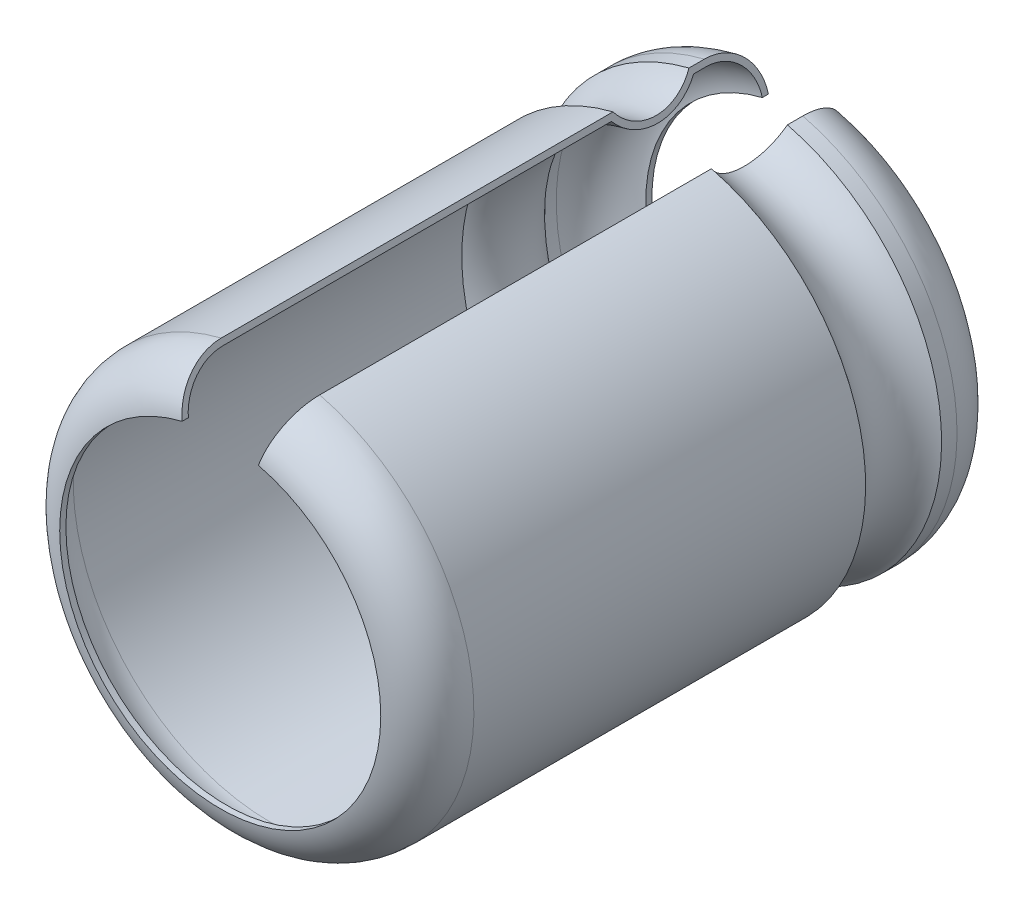
ISO-10303-21;
HEADER;
FILE_DESCRIPTION(('STEP AP214'),'2;1');
FILE_NAME('part.step','',(''),(''),'','','');
FILE_SCHEMA(('AUTOMOTIVE_DESIGN { 1 0 10303 214 1 1 1 1 }'));
ENDSEC;
DATA;
#1=APPLICATION_CONTEXT('core data for automotive mechanical design processes');
#2=APPLICATION_PROTOCOL_DEFINITION('international standard','automotive_design',2000,#1);
#3=PRODUCT_CONTEXT('',#1,'mechanical');
#4=PRODUCT('Part','Part','',(#3));
#5=PRODUCT_RELATED_PRODUCT_CATEGORY('part','',(#4));
#6=PRODUCT_DEFINITION_FORMATION('','',#4);
#7=PRODUCT_DEFINITION_CONTEXT('part definition',#1,'design');
#8=PRODUCT_DEFINITION('design','',#6,#7);
#9=PRODUCT_DEFINITION_SHAPE('','',#8);
#10=(LENGTH_UNIT() NAMED_UNIT(*) SI_UNIT(.MILLI.,.METRE.));
#11=(NAMED_UNIT(*) PLANE_ANGLE_UNIT() SI_UNIT($,.RADIAN.));
#12=(NAMED_UNIT(*) SI_UNIT($,.STERADIAN.) SOLID_ANGLE_UNIT());
#13=UNCERTAINTY_MEASURE_WITH_UNIT(LENGTH_MEASURE(1.E-05),#10,'distance_accuracy_value','');
#14=(GEOMETRIC_REPRESENTATION_CONTEXT(3) GLOBAL_UNCERTAINTY_ASSIGNED_CONTEXT((#13)) GLOBAL_UNIT_ASSIGNED_CONTEXT((#10,
#11,#12)) REPRESENTATION_CONTEXT('',''));
#15=CARTESIAN_POINT('',(0.,0.,0.));
#16=DIRECTION('',(0.,0.,1.));
#17=DIRECTION('',(1.,0.,0.));
#18=AXIS2_PLACEMENT_3D('',#15,#16,#17);
#19=CARTESIAN_POINT('',(-127.923352159799,-34.2539777719783,-4.75000000000004));
#20=DIRECTION('',(0.,0.,-1.));
#21=DIRECTION('',(0.,1.,0.));
#22=AXIS2_PLACEMENT_3D('',#19,#20,#21);
#23=TOROIDAL_SURFACE('',#22,3.,0.879999999999999);
#24=CARTESIAN_POINT('',(-127.214089814137,-31.3390254696198,-5.63000000000004));
#25=CARTESIAN_POINT('',(-127.201271562291,-31.2911871024664,-5.63004204608304));
#26=CARTESIAN_POINT('',(-127.188456520639,-31.2433607159227,-5.62582380646346));
#27=CARTESIAN_POINT('',(-127.163198578153,-31.1490967912701,-5.60917617710594));
#28=CARTESIAN_POINT('',(-127.150755396508,-31.1026582051611,-5.59675315584463));
#29=CARTESIAN_POINT('',(-127.12658004995,-31.0124345835161,-5.56399655739442));
#30=CARTESIAN_POINT('',(-127.114848233109,-30.9686508469994,-5.54365914321936));
#31=CARTESIAN_POINT('',(-127.092436914726,-30.8850106681286,-5.49566814365897));
#32=CARTESIAN_POINT('',(-127.081757225106,-30.8451535238608,-5.46801586913952));
#33=CARTESIAN_POINT('',(-127.061752943307,-30.7704965278154,-5.40617989210843));
#34=CARTESIAN_POINT('',(-127.052428129324,-30.7356958482616,-5.37199726078445));
#35=CARTESIAN_POINT('',(-127.035394622727,-30.6721259362081,-5.29805962623168));
#36=CARTESIAN_POINT('',(-127.027686246507,-30.6433578845116,-5.25830353461153));
#37=CARTESIAN_POINT('',(-127.014107234777,-30.592680322819,-5.17435865695596));
#38=CARTESIAN_POINT('',(-127.008236599728,-30.5707708145432,-5.13016986980857));
#39=CARTESIAN_POINT('',(-126.998502098692,-30.5344411620898,-5.03861981619895));
#40=CARTESIAN_POINT('',(-126.994637052204,-30.5200166122251,-4.99126043454381));
#41=CARTESIAN_POINT('',(-126.989985440392,-30.5026565606043,-4.91134196934457));
#42=CARTESIAN_POINT('',(-126.988597482868,-30.4974766326082,-4.8792861626896));
#43=CARTESIAN_POINT('',(-126.986745879569,-30.4905663550198,-4.81482472229106));
#44=CARTESIAN_POINT('',(-126.986280923045,-30.4888311136482,-4.78241965043));
#45=CARTESIAN_POINT('',(-126.986281985889,-30.4888350802375,-4.75000000000004));
#46=B_SPLINE_CURVE_WITH_KNOTS('',3,(#24,#25,#26,#27,#28,#29,#30,#31,#32,#33,#34,#35,#36,#37,#38,
#39,#40,#41,#42,#43,#44,#45),.UNSPECIFIED.,.F.,.F.,(4,2,2,2,2,2,2,2,2,2,4),(0.,
0.148380689225243,0.296646341856285,0.444983965062927,0.593295023284845,0.741581774598731,
0.889897523951605,1.03821331051062,1.1864416982842,1.2837608293245,1.38094165888656),.UNSPECIFIED.);
#47=CARTESIAN_POINT('',(-127.214089814137,-31.3390254696197,-5.63000000000004));
#48=VERTEX_POINT('',#47);
#49=CARTESIAN_POINT('',(-126.986281985889,-30.4888350802376,-4.75000000000004));
#50=VERTEX_POINT('',#49);
#51=EDGE_CURVE('E120',#48,#50,#46,.T.);
#52=ORIENTED_EDGE('',*,*,#51,.F.);
#53=CARTESIAN_POINT('',(-127.923352159799,-34.2539777719783,-5.63000000000004));
#54=DIRECTION('',(0.,0.,1.));
#55=DIRECTION('',(1.,0.,0.));
#56=AXIS2_PLACEMENT_3D('',#53,#54,#55);
#57=CIRCLE('',#56,3.);
#58=CARTESIAN_POINT('',(-128.632283154142,-31.3389448656015,-5.63000000000004));
#59=VERTEX_POINT('',#58);
#60=EDGE_CURVE('E119',#48,#59,#57,.F.);
#61=ORIENTED_EDGE('',*,*,#60,.T.);
#62=CARTESIAN_POINT('',(-128.860350714301,-30.488817256295,-4.75000000000005));
#63=CARTESIAN_POINT('',(-128.860361616344,-30.4887766186541,-4.79950093415175));
#64=CARTESIAN_POINT('',(-128.859268948501,-30.4928495657253,-4.84898926810134));
#65=CARTESIAN_POINT('',(-128.854956932925,-30.5089227130426,-4.94652790168075));
#66=CARTESIAN_POINT('',(-128.8517392619,-30.5209166633192,-4.99457930388328));
#67=CARTESIAN_POINT('',(-128.843255435687,-30.5525403404944,-5.08793595120537));
#68=CARTESIAN_POINT('',(-128.837988299776,-30.5721737230626,-5.13323986956688));
#69=CARTESIAN_POINT('',(-128.82555974705,-30.6185014682651,-5.21978505153724));
#70=CARTESIAN_POINT('',(-128.818398661888,-30.6451945946543,-5.2610270247074));
#71=CARTESIAN_POINT('',(-128.802383891916,-30.70489005551,-5.33828880937691));
#72=CARTESIAN_POINT('',(-128.793530118003,-30.7378927221081,-5.37430834579381));
#73=CARTESIAN_POINT('',(-128.774379546852,-30.8092769613153,-5.44010793000356));
#74=CARTESIAN_POINT('',(-128.76408246789,-30.8476595840542,-5.46988675681537));
#75=CARTESIAN_POINT('',(-128.74233655416,-30.9287180284855,-5.52236011912431));
#76=CARTESIAN_POINT('',(-128.730887312397,-30.9713953672584,-5.54505213955629));
#77=CARTESIAN_POINT('',(-128.707166581547,-31.0598149925403,-5.58268592770873));
#78=CARTESIAN_POINT('',(-128.694895575416,-31.1055554788203,-5.59763220328428));
#79=CARTESIAN_POINT('',(-128.674171996162,-31.1828031455843,-5.61564346497772));
#80=CARTESIAN_POINT('',(-128.665849579542,-31.213825164411,-5.62102396331695));
#81=CARTESIAN_POINT('',(-128.649113652187,-31.2762087576843,-5.62820176179252));
#82=CARTESIAN_POINT('',(-128.640700287812,-31.3075697865711,-5.63000414621183));
#83=CARTESIAN_POINT('',(-128.632283154142,-31.3389448656015,-5.63000000000004));
#84=B_SPLINE_CURVE_WITH_KNOTS('',3,(#62,#63,#64,#65,#66,#67,#68,#69,#70,#71,#72,#73,#74,#75,#76,
#77,#78,#79,#80,#81,#82,#83),.UNSPECIFIED.,.F.,.F.,(4,2,2,2,2,2,2,2,2,2,4),(0.,
0.148305442274034,0.296494005558433,0.444753568352633,0.592987186303494,0.74122860935858,
0.889499008499726,1.03782196827844,1.18605851010696,1.28357241911163,1.38094766730213),.UNSPECIFIED.);
#85=CARTESIAN_POINT('',(-128.860350714301,-30.488817256295,-4.75000000000005));
#86=VERTEX_POINT('',#85);
#87=EDGE_CURVE('E30',#86,#59,#84,.T.);
#88=ORIENTED_EDGE('',*,*,#87,.F.);
#89=CARTESIAN_POINT('',(-127.923352159799,-34.2539777719783,-4.75000000000005));
#90=DIRECTION('',(0.,0.,1.));
#91=DIRECTION('',(1.,0.,0.));
#92=AXIS2_PLACEMENT_3D('',#89,#90,#91);
#93=CIRCLE('',#92,3.87999999999999);
#94=EDGE_CURVE('E111',#86,#50,#93,.T.);
#95=ORIENTED_EDGE('',*,*,#94,.T.);
#96=EDGE_LOOP('',(#52,#61,#88,#95));
#97=FACE_BOUND('',#96,.T.);
#98=ADVANCED_FACE('F25',(#97),#23,.F.);
#99=CARTESIAN_POINT('',(-127.923352159799,-34.2539777719783,-5.75000000000004));
#100=DIRECTION('',(0.,0.,1.));
#101=DIRECTION('',(1.,0.,0.));
#102=AXIS2_PLACEMENT_3D('',#99,#100,#101);
#103=CYLINDRICAL_SURFACE('',#102,3.);
#104=CARTESIAN_POINT('',(-127.923352159799,-34.2539777719783,-5.75000000000004));
#105=DIRECTION('',(0.,0.,1.));
#106=DIRECTION('',(0.,-1.,0.));
#107=AXIS2_PLACEMENT_3D('',#104,#105,#106);
#108=CIRCLE('',#107,2.99999999999987);
#109=CARTESIAN_POINT('',(-128.632283154142,-31.3389448656015,-5.75000000000005));
#110=VERTEX_POINT('',#109);
#111=CARTESIAN_POINT('',(-127.214089814137,-31.3390254696197,-5.75000000000004));
#112=VERTEX_POINT('',#111);
#113=EDGE_CURVE('E212',#110,#112,#108,.T.);
#114=ORIENTED_EDGE('',*,*,#113,.F.);
#115=DIRECTION('',(0.,0.,1.));
#116=VECTOR('',#115,1.);
#117=CARTESIAN_POINT('',(-128.632283154142,-31.3389448656015,-5.75000000000004));
#118=LINE('',#117,#116);
#119=EDGE_CURVE('E131',#59,#110,#118,.F.);
#120=ORIENTED_EDGE('',*,*,#119,.F.);
#121=ORIENTED_EDGE('',*,*,#60,.F.);
#122=DIRECTION('',(0.,0.,1.));
#123=VECTOR('',#122,1.);
#124=CARTESIAN_POINT('',(-127.214089814137,-31.3390254696197,-5.75000000000004));
#125=LINE('',#124,#123);
#126=EDGE_CURVE('E136',#112,#48,#125,.T.);
#127=ORIENTED_EDGE('',*,*,#126,.F.);
#128=EDGE_LOOP('',(#114,#120,#121,#127));
#129=FACE_BOUND('',#128,.T.);
#130=ADVANCED_FACE('F225',(#129),#103,.F.);
#131=CARTESIAN_POINT('',(-127.923352159799,-34.2539777719783,-4.59832371114474));
#132=DIRECTION('',(0.,0.,1.));
#133=DIRECTION('',(1.,0.,0.));
#134=AXIS2_PLACEMENT_3D('',#131,#132,#133);
#135=CYLINDRICAL_SURFACE('',#134,3.87999999999999);
#136=ORIENTED_EDGE('',*,*,#94,.F.);
#137=DIRECTION('',(0.,0.,1.));
#138=VECTOR('',#137,1.);
#139=CARTESIAN_POINT('',(-128.860350714301,-30.488817256295,-4.59832371114474));
#140=LINE('',#139,#138);
#141=CARTESIAN_POINT('',(-128.860350714301,-30.488817256295,-4.50801829769925));
#142=VERTEX_POINT('',#141);
#143=EDGE_CURVE('E99',#142,#86,#140,.F.);
#144=ORIENTED_EDGE('',*,*,#143,.F.);
#145=CARTESIAN_POINT('',(-127.923352159799,-34.2539777719783,-4.50801829769926));
#146=DIRECTION('',(0.,0.,-1.));
#147=DIRECTION('',(-1.,0.,0.));
#148=AXIS2_PLACEMENT_3D('',#145,#146,#147);
#149=CIRCLE('',#148,3.88000000000005);
#150=CARTESIAN_POINT('',(-126.986281985889,-30.4888350802375,-4.50801829769923));
#151=VERTEX_POINT('',#150);
#152=EDGE_CURVE('E239',#151,#142,#149,.T.);
#153=ORIENTED_EDGE('',*,*,#152,.F.);
#154=DIRECTION('',(0.,0.,1.));
#155=VECTOR('',#154,1.);
#156=CARTESIAN_POINT('',(-126.986281985889,-30.4888350802376,-4.59832371114474));
#157=LINE('',#156,#155);
#158=EDGE_CURVE('E112',#50,#151,#157,.T.);
#159=ORIENTED_EDGE('',*,*,#158,.F.);
#160=EDGE_LOOP('',(#136,#144,#153,#159));
#161=FACE_BOUND('',#160,.T.);
#162=ADVANCED_FACE('F122',(#161),#135,.F.);
#163=CARTESIAN_POINT('',(-127.923352159799,-34.2539777719783,-4.75000000000004));
#164=DIRECTION('',(0.,0.,-1.));
#165=DIRECTION('',(0.,1.,0.));
#166=AXIS2_PLACEMENT_3D('',#163,#164,#165);
#167=TOROIDAL_SURFACE('',#166,2.99999999999998,0.999999999999999);
#168=CARTESIAN_POINT('',(-128.891449170772,-30.3728969718217,-4.75000000000005));
#169=CARTESIAN_POINT('',(-128.891449122738,-30.3728971508716,-4.778131315843));
#170=CARTESIAN_POINT('',(-128.891141349034,-30.3740443851504,-4.80624915375239));
#171=CARTESIAN_POINT('',(-128.889913517564,-30.3786211580675,-4.862283603416));
#172=CARTESIAN_POINT('',(-128.888993489314,-30.3820505866817,-4.89020022480523));
#173=CARTESIAN_POINT('',(-128.885323776576,-30.395729533896,-4.97329929490051));
#174=CARTESIAN_POINT('',(-128.881664439774,-30.4093698045449,-5.02792507963576));
#175=CARTESIAN_POINT('',(-128.872021568321,-30.4453138522186,-5.13402872143757));
#176=CARTESIAN_POINT('',(-128.866036920699,-30.4676217778697,-5.18550505739692));
#177=CARTESIAN_POINT('',(-128.851914029222,-30.5202652136992,-5.2838483371582));
#178=CARTESIAN_POINT('',(-128.843776162589,-30.550599317771,-5.33071608636785));
#179=CARTESIAN_POINT('',(-128.82557729531,-30.6184360566805,-5.41851502552918));
#180=CARTESIAN_POINT('',(-128.815516202787,-30.6559390339881,-5.45944593170285));
#181=CARTESIAN_POINT('',(-128.79375413257,-30.737057702134,-5.53421783551356));
#182=CARTESIAN_POINT('',(-128.782052834837,-30.7806745859229,-5.56805744626829));
#183=CARTESIAN_POINT('',(-128.757341552393,-30.8727865173728,-5.62768575402393));
#184=CARTESIAN_POINT('',(-128.744331117764,-30.9212832421118,-5.65347167059268));
#185=CARTESIAN_POINT('',(-128.717375885,-31.0217595552349,-5.69623643170859));
#186=CARTESIAN_POINT('',(-128.703431635671,-31.0737370979304,-5.71322039877971));
#187=CARTESIAN_POINT('',(-128.679882503768,-31.1615170837894,-5.73368681262412));
#188=CARTESIAN_POINT('',(-128.670425526539,-31.1967682060359,-5.73980062599478));
#189=CARTESIAN_POINT('',(-128.651408067685,-31.2676562657808,-5.74795668601604));
#190=CARTESIAN_POINT('',(-128.641847752381,-31.3032925833183,-5.75000471049615));
#191=CARTESIAN_POINT('',(-128.632283154142,-31.3389448656015,-5.75000000000004));
#192=B_SPLINE_CURVE_WITH_KNOTS('',3,(#168,#169,#170,#171,#172,#173,#174,#175,#176,#177,#178,
#179,#180,#181,#182,#183,#184,#185,#186,#187,#188,#189,#190,#191),.UNSPECIFIED.,.F.,.F.,(4,2,2,
2,2,2,2,2,2,2,2,4),(0.,0.0843421075145434,0.168680149211276,0.337077436757863,0.505555424305203,
0.674003915708322,0.842460456210385,1.01094991196813,1.17949747236409,1.34794683164901,
1.45875433061319,1.56940424971757),.UNSPECIFIED.);
#193=CARTESIAN_POINT('',(-128.891449170772,-30.3728969718217,-4.75000000000006));
#194=VERTEX_POINT('',#193);
#195=EDGE_CURVE('E127',#194,#110,#192,.T.);
#196=ORIENTED_EDGE('',*,*,#195,.T.);
#197=ORIENTED_EDGE('',*,*,#113,.T.);
#198=CARTESIAN_POINT('',(-127.214089814137,-31.3390254696198,-5.75000000000004));
#199=CARTESIAN_POINT('',(-127.206805325658,-31.3118393885118,-5.74999981047963));
#200=CARTESIAN_POINT('',(-127.199524324563,-31.2846663224935,-5.74881166942768));
#201=CARTESIAN_POINT('',(-127.185014403124,-31.2305145584674,-5.74407156695708));
#202=CARTESIAN_POINT('',(-127.177785480354,-31.2035358514079,-5.7405197163507));
#203=CARTESIAN_POINT('',(-127.156267018249,-31.1232278575308,-5.72635206846522));
#204=CARTESIAN_POINT('',(-127.142121589224,-31.0704363977132,-5.71222408291305));
#205=CARTESIAN_POINT('',(-127.114645765372,-30.9678952271201,-5.67499295143569));
#206=CARTESIAN_POINT('',(-127.101315769705,-30.9181470060259,-5.65188545004277));
#207=CARTESIAN_POINT('',(-127.075849688168,-30.82310629586,-5.59735289530389));
#208=CARTESIAN_POINT('',(-127.063713388853,-30.7778130102014,-5.56592933267494));
#209=CARTESIAN_POINT('',(-127.040981198399,-30.6929753204595,-5.49566130375273));
#210=CARTESIAN_POINT('',(-127.030385051107,-30.6534299604014,-5.45681807396498));
#211=CARTESIAN_POINT('',(-127.011029085977,-30.5811925151058,-5.37279922010289));
#212=CARTESIAN_POINT('',(-127.002269627728,-30.5485017718736,-5.3276223589059));
#213=CARTESIAN_POINT('',(-126.986838983098,-30.4909138221203,-5.23223132832219));
#214=CARTESIAN_POINT('',(-126.980167811733,-30.4660166716398,-5.18201712271732));
#215=CARTESIAN_POINT('',(-126.969105841981,-30.4247328384925,-5.07798362140517));
#216=CARTESIAN_POINT('',(-126.964713702402,-30.4083411504305,-5.02416646710693));
#217=CARTESIAN_POINT('',(-126.959427597755,-30.3886131393154,-4.93334919428128));
#218=CARTESIAN_POINT('',(-126.957850283471,-30.3827265222664,-4.8969209526425));
#219=CARTESIAN_POINT('',(-126.955746069166,-30.3748734875702,-4.82366690405275));
#220=CARTESIAN_POINT('',(-126.955217679564,-30.3729015107299,-4.78684173566062));
#221=CARTESIAN_POINT('',(-126.955218887053,-30.3729060171402,-4.75000000000004));
#222=B_SPLINE_CURVE_WITH_KNOTS('',3,(#198,#199,#200,#201,#202,#203,#204,#205,#206,#207,#208,
#209,#210,#211,#212,#213,#214,#215,#216,#217,#218,#219,#220,#221),.UNSPECIFIED.,.F.,.F.,(4,2,2,
2,2,2,2,2,2,2,2,4),(0.,0.0843834656995317,0.168762975725182,0.337245107529012,0.505809062929505,
0.67434282240664,0.84284851979009,1.01138717668631,1.17992704545077,1.34836761706643,
1.45896121031577,1.56939763657526),.UNSPECIFIED.);
#223=CARTESIAN_POINT('',(-126.955218887053,-30.3729060171402,-4.75000000000004));
#224=VERTEX_POINT('',#223);
#225=EDGE_CURVE('E124',#112,#224,#222,.T.);
#226=ORIENTED_EDGE('',*,*,#225,.T.);
#227=CARTESIAN_POINT('',(-127.923352159799,-34.2539777719783,-4.75000000000006));
#228=DIRECTION('',(0.,0.,1.));
#229=DIRECTION('',(1.,0.,0.));
#230=AXIS2_PLACEMENT_3D('',#227,#228,#229);
#231=CIRCLE('',#230,4.);
#232=EDGE_CURVE('E242',#194,#224,#231,.T.);
#233=ORIENTED_EDGE('',*,*,#232,.F.);
#234=EDGE_LOOP('',(#196,#197,#226,#233));
#235=FACE_BOUND('',#234,.T.);
#236=ADVANCED_FACE('F216',(#235),#167,.T.);
#237=CARTESIAN_POINT('',(-127.923352159799,-34.2539777719783,0.898559059800306));
#238=DIRECTION('',(0.,0.,1.));
#239=DIRECTION('',(1.,0.,0.));
#240=AXIS2_PLACEMENT_3D('',#237,#238,#239);
#241=CYLINDRICAL_SURFACE('',#240,3.87999999999999);
#242=CARTESIAN_POINT('',(-127.923352159799,-34.2539777719783,-2.89151100498956));
#243=DIRECTION('',(0.,0.,1.));
#244=DIRECTION('',(1.,0.,0.));
#245=AXIS2_PLACEMENT_3D('',#242,#243,#244);
#246=CIRCLE('',#245,3.88000000000002);
#247=CARTESIAN_POINT('',(-128.860350714301,-30.488817256295,-2.89151100498956));
#248=VERTEX_POINT('',#247);
#249=CARTESIAN_POINT('',(-126.986281985889,-30.4888350802376,-2.89151100498958));
#250=VERTEX_POINT('',#249);
#251=EDGE_CURVE('E248',#248,#250,#246,.T.);
#252=ORIENTED_EDGE('',*,*,#251,.F.);
#253=DIRECTION('',(0.,0.,1.));
#254=VECTOR('',#253,1.);
#255=CARTESIAN_POINT('',(-128.860350714301,-30.488817256295,-0.00616074521093424));
#256=LINE('',#255,#254);
#257=CARTESIAN_POINT('',(-128.860350714301,-30.488817256295,4.74999999999995));
#258=VERTEX_POINT('',#257);
#259=EDGE_CURVE('E185',#248,#258,#256,.T.);
#260=ORIENTED_EDGE('',*,*,#259,.T.);
#261=CARTESIAN_POINT('',(-127.923352159799,-34.2539777719783,4.74999999999996));
#262=DIRECTION('',(0.,0.,1.));
#263=DIRECTION('',(1.,0.,0.));
#264=AXIS2_PLACEMENT_3D('',#261,#262,#263);
#265=CIRCLE('',#264,3.88);
#266=CARTESIAN_POINT('',(-126.986281985889,-30.4888350802376,4.74999999999996));
#267=VERTEX_POINT('',#266);
#268=EDGE_CURVE('E244',#258,#267,#265,.T.);
#269=ORIENTED_EDGE('',*,*,#268,.T.);
#270=DIRECTION('',(0.,0.,1.));
#271=VECTOR('',#270,1.);
#272=CARTESIAN_POINT('',(-126.986281985889,-30.4888350802376,-0.00616074521092003));
#273=LINE('',#272,#271);
#274=EDGE_CURVE('E275',#267,#250,#273,.F.);
#275=ORIENTED_EDGE('',*,*,#274,.T.);
#276=EDGE_LOOP('',(#252,#260,#269,#275));
#277=FACE_BOUND('',#276,.T.);
#278=ADVANCED_FACE('F219',(#277),#241,.F.);
#279=CARTESIAN_POINT('',(-127.923352159799,-34.2539777719783,-3.6997646513444));
#280=DIRECTION('',(0.,0.,-1.));
#281=DIRECTION('',(-1.,0.,0.));
#282=AXIS2_PLACEMENT_3D('',#279,#280,#281);
#283=TOROIDAL_SURFACE('',#282,4.50254962796093,1.02021664175807);
#284=CARTESIAN_POINT('',(-128.860350714301,-30.488817256295,-4.50801829769924));
#285=CARTESIAN_POINT('',(-128.854458112635,-30.510782078313,-4.4905045256412));
#286=CARTESIAN_POINT('',(-128.848759871915,-30.5320224149804,-4.47203926263992));
#287=CARTESIAN_POINT('',(-128.837786645832,-30.5729253932456,-4.43332397744214));
#288=CARTESIAN_POINT('',(-128.832511640616,-30.5925881088474,-4.41307403905586));
#289=CARTESIAN_POINT('',(-128.817388367267,-30.6489604934519,-4.34988834439873));
#290=CARTESIAN_POINT('',(-128.808223064298,-30.6831243925022,-4.30446078717369));
#291=CARTESIAN_POINT('',(-128.791999262984,-30.743599022981,-4.20831378752638));
#292=CARTESIAN_POINT('',(-128.784941741765,-30.769906112149,-4.15759190541845));
#293=CARTESIAN_POINT('',(-128.773133764263,-30.8139206474794,-4.0522990828791));
#294=CARTESIAN_POINT('',(-128.768382842842,-30.8316298274552,-3.99772892101745));
#295=CARTESIAN_POINT('',(-128.761323275228,-30.8579445446141,-3.88629162598268));
#296=CARTESIAN_POINT('',(-128.759014398365,-30.866550941623,-3.82942471028199));
#297=CARTESIAN_POINT('',(-128.756903168338,-30.8744206050445,-3.71499432317547));
#298=CARTESIAN_POINT('',(-128.757101127049,-30.8736827089314,-3.65743076599033));
#299=CARTESIAN_POINT('',(-128.759998294704,-30.8628834430886,-3.54326449871749));
#300=CARTESIAN_POINT('',(-128.762696863342,-30.8528244601148,-3.48666154643556));
#301=CARTESIAN_POINT('',(-128.770518811584,-30.8236679498482,-3.3759969470987));
#302=CARTESIAN_POINT('',(-128.775642567982,-30.8045690180497,-3.32193569637453));
#303=CARTESIAN_POINT('',(-128.788170503772,-30.7578708199557,-3.21787798689188));
#304=CARTESIAN_POINT('',(-128.795575904249,-30.730267002041,-3.16788372284417));
#305=CARTESIAN_POINT('',(-128.812454488635,-30.6673516510699,-3.07343779227478));
#306=CARTESIAN_POINT('',(-128.821925303313,-30.6320489493844,-3.02897986608554));
#307=CARTESIAN_POINT('',(-128.836661304666,-30.5771201309555,-2.97059166046914));
#308=CARTESIAN_POINT('',(-128.841198866468,-30.5602062543674,-2.95385185714401));
#309=CARTESIAN_POINT('',(-128.850562234656,-30.5253040621946,-2.92168896123197));
#310=CARTESIAN_POINT('',(-128.855387496156,-30.5073177776913,-2.90626350605));
#311=CARTESIAN_POINT('',(-128.860350714301,-30.488817256295,-2.89151100498955));
#312=B_SPLINE_CURVE_WITH_KNOTS('',3,(#284,#285,#286,#287,#288,#289,#290,#291,#292,#293,#294,
#295,#296,#297,#298,#299,#300,#301,#302,#303,#304,#305,#306,#307,#308,#309,#310,#311),
.UNSPECIFIED.,.F.,.F.,(4,2,2,2,2,2,2,2,2,2,2,2,2,4),(0.,0.0860585380575555,0.172113036867735,
0.343950923403645,0.515868347348686,0.68775108883169,0.859617593257397,1.03150547984229,
1.20334936500021,1.37521995772021,1.54718269186648,1.71894919593121,1.79157671436656,
1.86407079944066),.UNSPECIFIED.);
#313=EDGE_CURVE('E106',#142,#248,#312,.T.);
#314=ORIENTED_EDGE('',*,*,#313,.T.);
#315=ORIENTED_EDGE('',*,*,#251,.T.);
#316=CARTESIAN_POINT('',(-126.986281985889,-30.4888350802376,-2.8915110049896));
#317=CARTESIAN_POINT('',(-126.992167899577,-30.5108016091708,-2.90902481469599));
#318=CARTESIAN_POINT('',(-126.997859670801,-30.5320435885621,-2.92749011639934));
#319=CARTESIAN_POINT('',(-127.008820434265,-30.5729497147006,-2.96620547677432));
#320=CARTESIAN_POINT('',(-127.014089446351,-30.5926139355088,-2.9864554515785));
#321=CARTESIAN_POINT('',(-127.029195529089,-30.6489906037906,-3.04964123642867));
#322=CARTESIAN_POINT('',(-127.038350405101,-30.6831570662062,-3.09506883762553));
#323=CARTESIAN_POINT('',(-127.054555736858,-30.7436361876754,-3.19121587044906));
#324=CARTESIAN_POINT('',(-127.061605216911,-30.769945205401,-3.24193774091887));
#325=CARTESIAN_POINT('',(-127.073399735984,-30.8139629498309,-3.34723049115928));
#326=CARTESIAN_POINT('',(-127.078145239383,-30.8316734096242,-3.4018005927551));
#327=CARTESIAN_POINT('',(-127.085196772445,-30.8579900892854,-3.51323798640278));
#328=CARTESIAN_POINT('',(-127.087503021231,-30.8665971269274,-3.57010507163657));
#329=CARTESIAN_POINT('',(-127.089611834827,-30.8744673264106,-3.68453578493789));
#330=CARTESIAN_POINT('',(-127.089414088106,-30.8737293256012,-3.74209949878548));
#331=CARTESIAN_POINT('',(-127.08652017222,-30.8629290844846,-3.85626631050607));
#332=CARTESIAN_POINT('',(-127.08382463248,-30.8528691932188,-3.91286964672744));
#333=CARTESIAN_POINT('',(-127.076011465322,-30.8237100564184,-4.02353499064394));
#334=CARTESIAN_POINT('',(-127.070893461477,-30.8046094060347,-4.07759660194308));
#335=CARTESIAN_POINT('',(-127.058379595373,-30.7579070219357,-4.18165490377003));
#336=CARTESIAN_POINT('',(-127.050982516711,-30.7303007485415,-4.23164940551753));
#337=CARTESIAN_POINT('',(-127.034122894131,-30.6673797804781,-4.32609572997447));
#338=CARTESIAN_POINT('',(-127.024662717063,-30.6320739190112,-4.37055381315841));
#339=CARTESIAN_POINT('',(-127.009943489283,-30.5771410130856,-4.42894125754336));
#340=CARTESIAN_POINT('',(-127.005411264683,-30.5602265206082,-4.4456802569811));
#341=CARTESIAN_POINT('',(-126.996058922294,-30.5253231036437,-4.47784165994802));
#342=CARTESIAN_POINT('',(-126.991239348711,-30.5073362101612,-4.49326642579104));
#343=CARTESIAN_POINT('',(-126.986281985889,-30.4888350802376,-4.50801829769923));
#344=B_SPLINE_CURVE_WITH_KNOTS('',3,(#316,#317,#318,#319,#320,#321,#322,#323,#324,#325,#326,
#327,#328,#329,#330,#331,#332,#333,#334,#335,#336,#337,#338,#339,#340,#341,#342,#343),
.UNSPECIFIED.,.F.,.F.,(4,2,2,2,2,2,2,2,2,2,2,2,2,4),(0.,0.0860584085147558,0.172112775026146,
0.343950353188239,0.515867441869075,0.687749865265642,0.859616846893063,1.03150521133529,
1.20335027307123,1.37522204668958,1.54718571225531,1.71895312405148,1.79157727616113,
1.86406800531797),.UNSPECIFIED.);
#345=EDGE_CURVE('E278',#250,#151,#344,.T.);
#346=ORIENTED_EDGE('',*,*,#345,.T.);
#347=ORIENTED_EDGE('',*,*,#152,.T.);
#348=EDGE_LOOP('',(#314,#315,#346,#347));
#349=FACE_BOUND('',#348,.T.);
#350=ADVANCED_FACE('F167',(#349),#283,.T.);
#351=CARTESIAN_POINT('',(-127.923352159799,-34.2539777719783,4.74999999999995));
#352=DIRECTION('',(0.,0.,-1.));
#353=DIRECTION('',(-1.,0.,0.));
#354=AXIS2_PLACEMENT_3D('',#351,#352,#353);
#355=TOROIDAL_SURFACE('',#354,2.99999999999999,0.880000000000009);
#356=ORIENTED_EDGE('',*,*,#268,.F.);
#357=CARTESIAN_POINT('',(-128.860350714301,-30.488817256295,4.74999999999995));
#358=CARTESIAN_POINT('',(-128.860361617174,-30.4887766155613,4.7994980868616));
#359=CARTESIAN_POINT('',(-128.859269074375,-30.4928490965284,4.84898358871686));
#360=CARTESIAN_POINT('',(-128.85495730079,-30.5089213418196,4.9465223868776));
#361=CARTESIAN_POINT('',(-128.851739503525,-30.5209157626565,4.99457662577682));
#362=CARTESIAN_POINT('',(-128.843255126052,-30.5525414946638,5.08793937770159));
#363=CARTESIAN_POINT('',(-128.837987532231,-30.5721765841042,5.13324651947102));
#364=CARTESIAN_POINT('',(-128.825558688514,-30.6185054139826,5.21979111824535));
#365=CARTESIAN_POINT('',(-128.81839804773,-30.645196883942,5.26102987845255));
#366=CARTESIAN_POINT('',(-128.80238586459,-30.7048827023182,5.33827940158157));
#367=CARTESIAN_POINT('',(-128.793534520196,-30.7378763128238,5.37429077570482));
#368=CARTESIAN_POINT('',(-128.774384478645,-30.8092585779317,5.44009342857739));
#369=CARTESIAN_POINT('',(-128.764084799436,-30.8476508931589,5.46988045251354));
#370=CARTESIAN_POINT('',(-128.742327344848,-30.9287523564278,5.52238302029414));
#371=CARTESIAN_POINT('',(-128.73086843652,-30.971465727568,5.54509155593152));
#372=CARTESIAN_POINT('',(-128.707143785475,-31.0598999654772,5.5827126340351));
#373=CARTESIAN_POINT('',(-128.694879985757,-31.1056135896696,5.59764322561766));
#374=CARTESIAN_POINT('',(-128.679224607053,-31.1639694104643,5.6112527852942));
#375=CARTESIAN_POINT('',(-128.676039834391,-31.1758407312607,5.61374604314221));
#376=CARTESIAN_POINT('',(-128.672843986712,-31.1877533344614,5.61597276994296));
#377=B_SPLINE_CURVE_WITH_KNOTS('',3,(#357,#358,#359,#360,#361,#362,#363,#364,#365,#366,#367,
#368,#369,#370,#371,#372,#373,#374,#375,#376),.UNSPECIFIED.,.F.,.F.,(4,2,2,2,2,2,2,2,2,4),(0.,
0.148296966243348,0.296494005603657,0.444764420924764,0.59298718632619,0.741192607100406,
0.889499008426525,1.0379517806541,1.18605850861084,1.22367004050746),.UNSPECIFIED.);
#378=CARTESIAN_POINT('',(-128.672843986712,-31.1877533344614,5.61597276994295));
#379=VERTEX_POINT('',#378);
#380=EDGE_CURVE('E179',#258,#379,#377,.T.);
#381=ORIENTED_EDGE('',*,*,#380,.T.);
#382=CARTESIAN_POINT('',(-127.923352159799,-34.2539777719785,5.61597276994293));
#383=DIRECTION('',(0.,0.,1.));
#384=DIRECTION('',(1.,0.,0.));
#385=AXIS2_PLACEMENT_3D('',#382,#383,#384);
#386=CIRCLE('',#385,3.15649652301971);
#387=CARTESIAN_POINT('',(-127.173575243677,-31.1878230342188,5.61597276994296));
#388=VERTEX_POINT('',#387);
#389=EDGE_CURVE('E259',#379,#388,#386,.T.);
#390=ORIENTED_EDGE('',*,*,#389,.T.);
#391=CARTESIAN_POINT('',(-127.173575243677,-31.1878230342188,5.61597276994298));
#392=CARTESIAN_POINT('',(-127.160961421447,-31.1407476087792,5.60721017647439));
#393=CARTESIAN_POINT('',(-127.148546751231,-31.0944154287717,5.59425833453616));
#394=CARTESIAN_POINT('',(-127.124459908798,-31.0045221090203,5.56052977430958));
#395=CARTESIAN_POINT('',(-127.112787251017,-30.9609591571207,5.53975823606916));
#396=CARTESIAN_POINT('',(-127.090505468307,-30.8778024119644,5.4909186285778));
#397=CARTESIAN_POINT('',(-127.079896879908,-30.8382106210614,5.46284690377328));
#398=CARTESIAN_POINT('',(-127.060053446564,-30.7641539196243,5.40023110101621));
#399=CARTESIAN_POINT('',(-127.050818155467,-30.7296873440275,5.36568913337138));
#400=CARTESIAN_POINT('',(-127.033982597401,-30.6668561859512,5.29111682568729));
#401=CARTESIAN_POINT('',(-127.02638178922,-30.6384895836412,5.25108830957116));
#402=CARTESIAN_POINT('',(-127.013022530115,-30.5886321499115,5.16663854499791));
#403=CARTESIAN_POINT('',(-127.007265339116,-30.5671460205948,5.12221431954563));
#404=CARTESIAN_POINT('',(-126.997760799593,-30.5316745961912,5.03023898865854));
#405=CARTESIAN_POINT('',(-126.994014782353,-30.5176942695244,4.9826858353662));
#406=CARTESIAN_POINT('',(-126.98865216749,-30.4976807183966,4.88590285463253));
#407=CARTESIAN_POINT('',(-126.987030611535,-30.4916289891832,4.83667720739667));
#408=CARTESIAN_POINT('',(-126.986350065178,-30.4890891556019,4.77489521424675));
#409=CARTESIAN_POINT('',(-126.986281569487,-30.4888335262028,4.76244497516775));
#410=CARTESIAN_POINT('',(-126.986281985889,-30.4888350802376,4.74999999999996));
#411=B_SPLINE_CURVE_WITH_KNOTS('',3,(#391,#392,#393,#394,#395,#396,#397,#398,#399,#400,#401,
#402,#403,#404,#405,#406,#407,#408,#409,#410),.UNSPECIFIED.,.F.,.F.,(4,2,2,2,2,2,2,2,2,4),(0.,
0.148355607620934,0.296613111592231,0.444944998640155,0.593228590345701,0.741463006351696,
0.889798510367838,1.03823208347783,1.18631860293522,1.22366526101776),.UNSPECIFIED.);
#412=EDGE_CURVE('E173',#388,#267,#411,.T.);
#413=ORIENTED_EDGE('',*,*,#412,.T.);
#414=EDGE_LOOP('',(#356,#381,#390,#413));
#415=FACE_BOUND('',#414,.T.);
#416=ADVANCED_FACE('F161',(#415),#355,.F.);
#417=CARTESIAN_POINT('',(-127.923352159799,-34.2539777719783,-4.59832371114474));
#418=DIRECTION('',(0.,0.,1.));
#419=DIRECTION('',(1.,0.,0.));
#420=AXIS2_PLACEMENT_3D('',#417,#418,#419);
#421=CYLINDRICAL_SURFACE('',#420,4.);
#422=CARTESIAN_POINT('',(-127.923352159799,-34.2539777719784,-4.44664742228947));
#423=DIRECTION('',(0.,0.,-1.));
#424=DIRECTION('',(-1.,0.,0.));
#425=AXIS2_PLACEMENT_3D('',#422,#423,#424);
#426=CIRCLE('',#425,4.00000000000005);
#427=CARTESIAN_POINT('',(-126.955218887053,-30.3729060171402,-4.44664742228944));
#428=VERTEX_POINT('',#427);
#429=CARTESIAN_POINT('',(-128.891449170772,-30.3728969718217,-4.44664742228945));
#430=VERTEX_POINT('',#429);
#431=EDGE_CURVE('E281',#428,#430,#426,.T.);
#432=ORIENTED_EDGE('',*,*,#431,.T.);
#433=DIRECTION('',(0.,0.,1.));
#434=VECTOR('',#433,1.);
#435=CARTESIAN_POINT('',(-128.891449170772,-30.3728969718216,-0.00616074521093424));
#436=LINE('',#435,#434);
#437=EDGE_CURVE('E264',#430,#194,#436,.F.);
#438=ORIENTED_EDGE('',*,*,#437,.T.);
#439=ORIENTED_EDGE('',*,*,#232,.T.);
#440=DIRECTION('',(0.,0.,1.));
#441=VECTOR('',#440,1.);
#442=CARTESIAN_POINT('',(-126.955218887053,-30.3729060171403,-0.00616074521092003));
#443=LINE('',#442,#441);
#444=EDGE_CURVE('E184',#224,#428,#443,.T.);
#445=ORIENTED_EDGE('',*,*,#444,.T.);
#446=EDGE_LOOP('',(#432,#438,#439,#445));
#447=FACE_BOUND('',#446,.T.);
#448=ADVANCED_FACE('F166',(#447),#421,.T.);
#449=CARTESIAN_POINT('',(-127.976286908973,-33.7841874912089,-0.00616074521093424));
#450=DIRECTION('',(-0.965847232213215,-0.259112184248583,0.));
#451=DIRECTION('',(0.259112184248583,-0.965847232213215,0.));
#452=AXIS2_PLACEMENT_3D('',#449,#450,#451);
#453=PLANE('',#452);
#454=ORIENTED_EDGE('',*,*,#259,.F.);
#455=ORIENTED_EDGE('',*,*,#313,.F.);
#456=ORIENTED_EDGE('',*,*,#143,.T.);
#457=ORIENTED_EDGE('',*,*,#87,.T.);
#458=ORIENTED_EDGE('',*,*,#119,.T.);
#459=ORIENTED_EDGE('',*,*,#195,.F.);
#460=ORIENTED_EDGE('',*,*,#437,.F.);
#461=CARTESIAN_POINT('',(-128.891449170772,-30.3728969718216,-4.44664742228946));
#462=CARTESIAN_POINT('',(-128.880554637741,-30.4135066197445,-4.41841270418572));
#463=CARTESIAN_POINT('',(-128.870292954404,-30.4517573043952,-4.38657035626989));
#464=CARTESIAN_POINT('',(-128.851299417463,-30.5225561946024,-4.31673694100533));
#465=CARTESIAN_POINT('',(-128.842566498053,-30.5551083729799,-4.27875019317492));
#466=CARTESIAN_POINT('',(-128.826874993737,-30.613598852913,-4.19763318234639));
#467=CARTESIAN_POINT('',(-128.819917237301,-30.6395340663241,-4.1545005314812));
#468=CARTESIAN_POINT('',(-128.807978026935,-30.6840377754793,-4.06435021358827));
#469=CARTESIAN_POINT('',(-128.802996141533,-30.7026078795487,-4.01733339746169));
#470=CARTESIAN_POINT('',(-128.795149176604,-30.7318576401478,-3.92074387609783));
#471=CARTESIAN_POINT('',(-128.792283862545,-30.7425381709075,-3.87117145469415));
#472=CARTESIAN_POINT('',(-128.788750091057,-30.7557103936674,-3.77086418763284));
#473=CARTESIAN_POINT('',(-128.788082051125,-30.7582005294404,-3.72012912290944));
#474=CARTESIAN_POINT('',(-128.788962931969,-30.7549170237755,-3.61895505808932));
#475=CARTESIAN_POINT('',(-128.790511484755,-30.7491447540273,-3.5685160102449));
#476=CARTESIAN_POINT('',(-128.795780707313,-30.7295035934302,-3.46936236817964));
#477=CARTESIAN_POINT('',(-128.799501133089,-30.7156356120815,-3.42064758090137));
#478=CARTESIAN_POINT('',(-128.809008270858,-30.680197515152,-3.32631471431238));
#479=CARTESIAN_POINT('',(-128.814795282216,-30.6586262836858,-3.28069708479292));
#480=CARTESIAN_POINT('',(-128.82827227016,-30.6083904696404,-3.19385787736127));
#481=CARTESIAN_POINT('',(-128.835961947288,-30.5797270033026,-3.15263560912609));
#482=CARTESIAN_POINT('',(-128.851331219926,-30.5224376501168,-3.08338461128079));
#483=CARTESIAN_POINT('',(-128.858712008948,-30.4949255720224,-3.05435895610029));
#484=CARTESIAN_POINT('',(-128.874410879197,-30.4364076353891,-3.00042229224888));
#485=CARTESIAN_POINT('',(-128.882728179293,-30.4054046885349,-2.97550789658159));
#486=CARTESIAN_POINT('',(-128.891449170772,-30.3728969718216,-2.95288188039936));
#487=B_SPLINE_CURVE_WITH_KNOTS('',3,(#461,#462,#463,#464,#465,#466,#467,#468,#469,#470,#471,
#472,#473,#474,#475,#476,#477,#478,#479,#480,#481,#482,#483,#484,#485,#486),.UNSPECIFIED.,.F.,
.F.,(4,2,2,2,2,2,2,2,2,2,2,2,4),(0.,0.151736871454943,0.30336753170677,0.455068829228552,
0.606736981342244,0.758388324849365,0.910068481412225,1.06172345959609,1.21336140361505,
1.36502132267523,1.51665738726401,1.63830267690486,1.75984724518528),.UNSPECIFIED.);
#488=CARTESIAN_POINT('',(-128.891449170772,-30.3728969718216,-2.95288188039935));
#489=VERTEX_POINT('',#488);
#490=EDGE_CURVE('E147',#430,#489,#487,.T.);
#491=ORIENTED_EDGE('',*,*,#490,.T.);
#492=DIRECTION('',(0.,0.,1.));
#493=VECTOR('',#492,1.);
#494=CARTESIAN_POINT('',(-128.891449170772,-30.3728969718216,0.898559059800306));
#495=LINE('',#494,#493);
#496=CARTESIAN_POINT('',(-128.891449170772,-30.3728969718216,4.74999999999996));
#497=VERTEX_POINT('',#496);
#498=EDGE_CURVE('E262',#497,#489,#495,.F.);
#499=ORIENTED_EDGE('',*,*,#498,.F.);
#500=CARTESIAN_POINT('',(-128.672843986712,-31.1877533344613,5.73767850957823));
#501=CARTESIAN_POINT('',(-128.680045906714,-31.1609079951696,5.73327539678307));
#502=CARTESIAN_POINT('',(-128.687196228771,-31.1342549885251,5.72770130504783));
#503=CARTESIAN_POINT('',(-128.701349578002,-31.0814980206465,5.71425033407408));
#504=CARTESIAN_POINT('',(-128.708352612034,-31.0553940338511,5.70637356229976));
#505=CARTESIAN_POINT('',(-128.729054303245,-30.978227955317,5.67937502565907));
#506=CARTESIAN_POINT('',(-128.742468067491,-30.9282278092113,5.65687118600049));
#507=CARTESIAN_POINT('',(-128.768125998256,-30.8325872221592,5.60349112197469));
#508=CARTESIAN_POINT('',(-128.780369577302,-30.7869489710345,5.57261072183369));
#509=CARTESIAN_POINT('',(-128.803337498796,-30.7013354616999,5.50336057317051));
#510=CARTESIAN_POINT('',(-128.814062299811,-30.6613584941696,5.46499309358977));
#511=CARTESIAN_POINT('',(-128.833686913666,-30.5882072487759,5.38186740768285));
#512=CARTESIAN_POINT('',(-128.842587290244,-30.5550308695615,5.33711118272329));
#513=CARTESIAN_POINT('',(-128.858319852757,-30.4963873441592,5.24243665237797));
#514=CARTESIAN_POINT('',(-128.865150783542,-30.4709248765763,5.19251523874961));
#515=CARTESIAN_POINT('',(-128.876546314916,-30.4284477446387,5.08893222312406));
#516=CARTESIAN_POINT('',(-128.88110964289,-30.411437823986,5.03526854012646));
#517=CARTESIAN_POINT('',(-128.887826002951,-30.3864024216799,4.92582808310517));
#518=CARTESIAN_POINT('',(-128.889983987137,-30.3783584809463,4.8700558958826));
#519=CARTESIAN_POINT('',(-128.891272564607,-30.3735552757786,4.79271069156098));
#520=CARTESIAN_POINT('',(-128.89145037406,-30.3728924865353,4.77134956153809));
#521=CARTESIAN_POINT('',(-128.891449170772,-30.3728969718217,4.74999999999996));
#522=B_SPLINE_CURVE_WITH_KNOTS('',3,(#500,#501,#502,#503,#504,#505,#506,#507,#508,#509,#510,
#511,#512,#513,#514,#515,#516,#517,#518,#519,#520,#521),.UNSPECIFIED.,.F.,.F.,(4,2,2,2,2,2,2,2,
2,2,4),(0.,0.0843717779416471,0.16873961895018,0.337214656137427,0.505773834143152,
0.674282009801217,0.842738038445675,1.01129603462808,1.17994852166605,1.34825314340074,
1.41232194920189),.UNSPECIFIED.);
#523=CARTESIAN_POINT('',(-128.672843986712,-31.1877533344614,5.73767850957824));
#524=VERTEX_POINT('',#523);
#525=EDGE_CURVE('E203',#524,#497,#522,.T.);
#526=ORIENTED_EDGE('',*,*,#525,.F.);
#527=DIRECTION('',(0.,0.,1.));
#528=VECTOR('',#527,1.);
#529=CARTESIAN_POINT('',(-128.672843986712,-31.1877533344615,5.97009304910193));
#530=LINE('',#529,#528);
#531=EDGE_CURVE('E263',#524,#379,#530,.F.);
#532=ORIENTED_EDGE('',*,*,#531,.T.);
#533=ORIENTED_EDGE('',*,*,#380,.F.);
#534=EDGE_LOOP('',(#454,#455,#456,#457,#458,#459,#460,#491,#499,#526,#532,#533));
#535=FACE_BOUND('',#534,.T.);
#536=ADVANCED_FACE('F102',(#535),#453,.F.);
#537=CARTESIAN_POINT('',(-127.990339457911,-34.2360285795462,-0.00616074521092003));
#538=DIRECTION('',(0.965925826289135,-0.258819045102272,0.));
#539=DIRECTION('',(0.258819045102272,0.965925826289135,0.));
#540=AXIS2_PLACEMENT_3D('',#537,#538,#539);
#541=PLANE('',#540);
#542=ORIENTED_EDGE('',*,*,#51,.T.);
#543=ORIENTED_EDGE('',*,*,#158,.T.);
#544=ORIENTED_EDGE('',*,*,#345,.F.);
#545=ORIENTED_EDGE('',*,*,#274,.F.);
#546=ORIENTED_EDGE('',*,*,#412,.F.);
#547=DIRECTION('',(0.,0.,1.));
#548=VECTOR('',#547,1.);
#549=CARTESIAN_POINT('',(-127.173575243677,-31.1878230342188,5.97009304910193));
#550=LINE('',#549,#548);
#551=CARTESIAN_POINT('',(-127.173575243677,-31.1878230342188,5.73767850957825));
#552=VERTEX_POINT('',#551);
#553=EDGE_CURVE('E286',#388,#552,#550,.T.);
#554=ORIENTED_EDGE('',*,*,#553,.T.);
#555=CARTESIAN_POINT('',(-126.955218887053,-30.3729060171402,4.74999999999996));
#556=CARTESIAN_POINT('',(-126.955218935323,-30.3729061972868,4.77813007713766));
#557=CARTESIAN_POINT('',(-126.955526331876,-30.3740534168411,4.80624667614215));
#558=CARTESIAN_POINT('',(-126.956752659539,-30.3786301339864,4.86227868112802));
#559=CARTESIAN_POINT('',(-126.957671561268,-30.3820595219245,4.89019409671068));
#560=CARTESIAN_POINT('',(-126.961337018661,-30.3957391951496,4.97329498132379));
#561=CARTESIAN_POINT('',(-126.964992349224,-30.4093810745309,5.02792372860629));
#562=CARTESIAN_POINT('',(-126.974624877155,-30.4453301581737,5.13403370014055));
#563=CARTESIAN_POINT('',(-126.98060321774,-30.4676416289799,5.18551336017961));
#564=CARTESIAN_POINT('',(-126.994710468324,-30.5202906049177,5.28385651062126));
#565=CARTESIAN_POINT('',(-127.002838735991,-30.5506257128262,5.33072137405771));
#566=CARTESIAN_POINT('',(-127.021014630868,-30.6184590759816,5.41850887625357));
#567=CARTESIAN_POINT('',(-127.031062071478,-30.6559566348218,5.45943209204039));
#568=CARTESIAN_POINT('',(-127.052799033145,-30.7370800801659,5.53420687199385));
#569=CARTESIAN_POINT('',(-127.064489543567,-30.7807096590297,5.56805414465069));
#570=CARTESIAN_POINT('',(-127.089184156752,-30.8728712101064,5.62771070487693));
#571=CARTESIAN_POINT('',(-127.102189396671,-30.9214074262515,5.65351295386097));
#572=CARTESIAN_POINT('',(-127.129117030339,-31.0219027232279,5.69626307866402));
#573=CARTESIAN_POINT('',(-127.143037483489,-31.0738545616462,5.71322904960344));
#574=CARTESIAN_POINT('',(-127.162633780357,-31.1469889371971,5.73028562190748));
#575=CARTESIAN_POINT('',(-127.168091889332,-31.1673588772086,5.73432715702297));
#576=CARTESIAN_POINT('',(-127.173575243677,-31.1878230342188,5.73767850957824));
#577=B_SPLINE_CURVE_WITH_KNOTS('',3,(#555,#556,#557,#558,#559,#560,#561,#562,#563,#564,#565,
#566,#567,#568,#569,#570,#571,#572,#573,#574,#575,#576),.UNSPECIFIED.,.F.,.F.,(4,2,2,2,2,2,2,2,
2,2,4),(0.,0.084338394532785,0.168672737086353,0.337078885797028,0.505568016990859,
0.674006865416278,0.842429344824195,1.01095367682648,1.1796250395839,1.34794962175481,
1.41231825054908),.UNSPECIFIED.);
#578=CARTESIAN_POINT('',(-126.955218887053,-30.3729060171402,4.74999999999996));
#579=VERTEX_POINT('',#578);
#580=EDGE_CURVE('E186',#579,#552,#577,.T.);
#581=ORIENTED_EDGE('',*,*,#580,.F.);
#582=DIRECTION('',(0.,0.,1.));
#583=VECTOR('',#582,1.);
#584=CARTESIAN_POINT('',(-126.955218887053,-30.3729060171402,0.898559059800306));
#585=LINE('',#584,#583);
#586=CARTESIAN_POINT('',(-126.955218887053,-30.3729060171403,-2.95288188039948));
#587=VERTEX_POINT('',#586);
#588=EDGE_CURVE('E146',#587,#579,#585,.T.);
#589=ORIENTED_EDGE('',*,*,#588,.F.);
#590=CARTESIAN_POINT('',(-126.955218887053,-30.3729060171405,-2.9528818803996));
#591=CARTESIAN_POINT('',(-126.96610105039,-30.4135188036092,-2.98111663687481));
#592=CARTESIAN_POINT('',(-126.976351075245,-30.4517724171471,-3.01295902231912));
#593=CARTESIAN_POINT('',(-126.995323019779,-30.5225766780659,-3.08279248220691));
#594=CARTESIAN_POINT('',(-127.004046004446,-30.5551313000388,-3.12077923558401));
#595=CARTESIAN_POINT('',(-127.019719648331,-30.6136261353568,-3.20189620808291));
#596=CARTESIAN_POINT('',(-127.026669480267,-30.6395632612448,-3.24502881432949));
#597=CARTESIAN_POINT('',(-127.038595090338,-30.684070243943,-3.33517899641087));
#598=CARTESIAN_POINT('',(-127.043571299277,-30.7026417085302,-3.38219572170956));
#599=CARTESIAN_POINT('',(-127.051409343585,-30.7318936881209,-3.47878523247294));
#600=CARTESIAN_POINT('',(-127.054271404035,-30.7425750431338,-3.528357745238));
#601=CARTESIAN_POINT('',(-127.057801160545,-30.7557482737696,-3.62866518323286));
#602=CARTESIAN_POINT('',(-127.058468439566,-30.7582385929784,-3.6794003275353));
#603=CARTESIAN_POINT('',(-127.057588551175,-30.7549548047978,-3.78057477862021));
#604=CARTESIAN_POINT('',(-127.056041741479,-30.7491820324214,-3.83101413186978));
#605=CARTESIAN_POINT('',(-127.050778448724,-30.7295391564452,-3.93016837604787));
#606=CARTESIAN_POINT('',(-127.047062209329,-30.7156699622108,-3.97888345998943));
#607=CARTESIAN_POINT('',(-127.037565765906,-30.6802287528658,-4.07321687809907));
#608=CARTESIAN_POINT('',(-127.031785263493,-30.6586556241673,-4.11883476343835));
#609=CARTESIAN_POINT('',(-127.018323426732,-30.6084153654117,-4.20567442559908));
#610=CARTESIAN_POINT('',(-127.010642391722,-30.5797493524985,-4.24689689324622));
#611=CARTESIAN_POINT('',(-126.995290569712,-30.5224555727678,-4.31614733582358));
#612=CARTESIAN_POINT('',(-126.98791828377,-30.4949418270641,-4.34517234986574));
#613=CARTESIAN_POINT('',(-126.972237514839,-30.4364204007138,-4.39910788924578));
#614=CARTESIAN_POINT('',(-126.963929812031,-30.4054156317387,-4.42402180128646));
#615=CARTESIAN_POINT('',(-126.955218887053,-30.3729060171402,-4.44664742228942));
#616=B_SPLINE_CURVE_WITH_KNOTS('',3,(#590,#591,#592,#593,#594,#595,#596,#597,#598,#599,#600,
#601,#602,#603,#604,#605,#606,#607,#608,#609,#610,#611,#612,#613,#614,#615),.UNSPECIFIED.,.F.,
.F.,(4,2,2,2,2,2,2,2,2,2,2,2,4),(0.,0.151736499438024,0.30336674948371,0.455067615256749,
0.606735349506325,0.758386934337081,0.910067333476388,1.06172322938261,1.21336209503784,
1.36502288865741,1.5166598105784,1.63830250628535,1.75984448766605),.UNSPECIFIED.);
#617=EDGE_CURVE('E139',#587,#428,#616,.T.);
#618=ORIENTED_EDGE('',*,*,#617,.T.);
#619=ORIENTED_EDGE('',*,*,#444,.F.);
#620=ORIENTED_EDGE('',*,*,#225,.F.);
#621=ORIENTED_EDGE('',*,*,#126,.T.);
#622=EDGE_LOOP('',(#542,#543,#544,#545,#546,#554,#581,#589,#618,#619,#620,#621));
#623=FACE_BOUND('',#622,.T.);
#624=ADVANCED_FACE('F152',(#623),#541,.F.);
#625=CARTESIAN_POINT('',(-127.923352159799,-34.2539777719785,5.97009304910193));
#626=DIRECTION('',(0.,0.,1.));
#627=DIRECTION('',(1.,0.,0.));
#628=AXIS2_PLACEMENT_3D('',#625,#626,#627);
#629=CYLINDRICAL_SURFACE('',#628,3.15649652301971);
#630=ORIENTED_EDGE('',*,*,#389,.F.);
#631=ORIENTED_EDGE('',*,*,#531,.F.);
#632=CARTESIAN_POINT('',(-127.923352159799,-34.2539777719783,5.73767850957825));
#633=DIRECTION('',(0.,0.,-1.));
#634=DIRECTION('',(-1.,0.,0.));
#635=AXIS2_PLACEMENT_3D('',#632,#633,#634);
#636=CIRCLE('',#635,3.15649652301957);
#637=EDGE_CURVE('E50',#552,#524,#636,.T.);
#638=ORIENTED_EDGE('',*,*,#637,.F.);
#639=ORIENTED_EDGE('',*,*,#553,.F.);
#640=EDGE_LOOP('',(#630,#631,#638,#639));
#641=FACE_BOUND('',#640,.T.);
#642=ADVANCED_FACE('F159',(#641),#629,.F.);
#643=CARTESIAN_POINT('',(-127.923352159799,-34.2539777719783,-3.69976465134441));
#644=DIRECTION('',(0.,0.,-1.));
#645=DIRECTION('',(-1.,0.,0.));
#646=AXIS2_PLACEMENT_3D('',#643,#644,#645);
#647=TOROIDAL_SURFACE('',#646,4.50254962796092,0.900216641758071);
#648=ORIENTED_EDGE('',*,*,#617,.F.);
#649=CARTESIAN_POINT('',(-127.923352159799,-34.2539777719783,-2.95288188039936));
#650=DIRECTION('',(0.,0.,1.));
#651=DIRECTION('',(1.,0.,0.));
#652=AXIS2_PLACEMENT_3D('',#649,#650,#651);
#653=CIRCLE('',#652,4.);
#654=EDGE_CURVE('E41',#489,#587,#653,.T.);
#655=ORIENTED_EDGE('',*,*,#654,.F.);
#656=ORIENTED_EDGE('',*,*,#490,.F.);
#657=ORIENTED_EDGE('',*,*,#431,.F.);
#658=EDGE_LOOP('',(#648,#655,#656,#657));
#659=FACE_BOUND('',#658,.T.);
#660=ADVANCED_FACE('F155',(#659),#647,.F.);
#661=CARTESIAN_POINT('',(-127.923352159799,-34.2539777719782,4.74999999999995));
#662=DIRECTION('',(0.,0.,-1.));
#663=DIRECTION('',(0.,1.,0.));
#664=AXIS2_PLACEMENT_3D('',#661,#662,#663);
#665=TOROIDAL_SURFACE('',#664,2.99999999999992,1.00000000000001);
#666=ORIENTED_EDGE('',*,*,#580,.T.);
#667=ORIENTED_EDGE('',*,*,#637,.T.);
#668=ORIENTED_EDGE('',*,*,#525,.T.);
#669=CARTESIAN_POINT('',(-127.923352159799,-34.2539777719783,4.74999999999996));
#670=DIRECTION('',(0.,0.,1.));
#671=DIRECTION('',(1.,0.,0.));
#672=AXIS2_PLACEMENT_3D('',#669,#670,#671);
#673=CIRCLE('',#672,4.);
#674=EDGE_CURVE('E13',#579,#497,#673,.F.);
#675=ORIENTED_EDGE('',*,*,#674,.F.);
#676=EDGE_LOOP('',(#666,#667,#668,#675));
#677=FACE_BOUND('',#676,.T.);
#678=ADVANCED_FACE('F27',(#677),#665,.T.);
#679=CARTESIAN_POINT('',(-127.923352159799,-34.2539777719783,0.898559059800306));
#680=DIRECTION('',(0.,0.,1.));
#681=DIRECTION('',(1.,0.,0.));
#682=AXIS2_PLACEMENT_3D('',#679,#680,#681);
#683=CYLINDRICAL_SURFACE('',#682,4.);
#684=ORIENTED_EDGE('',*,*,#654,.T.);
#685=ORIENTED_EDGE('',*,*,#588,.T.);
#686=ORIENTED_EDGE('',*,*,#674,.T.);
#687=ORIENTED_EDGE('',*,*,#498,.T.);
#688=EDGE_LOOP('',(#684,#685,#686,#687));
#689=FACE_BOUND('',#688,.T.);
#690=ADVANCED_FACE('F322',(#689),#683,.T.);
#691=CLOSED_SHELL('',(#98,#130,#162,#236,#278,#350,#416,#448,#536,#624,#642,#660,#678,#690));
#692=MANIFOLD_SOLID_BREP('B1',#691);
#693=ADVANCED_BREP_SHAPE_REPRESENTATION('',(#18,#692),#14);
#694=SHAPE_DEFINITION_REPRESENTATION(#9,#693);
ENDSEC;
END-ISO-10303-21;
